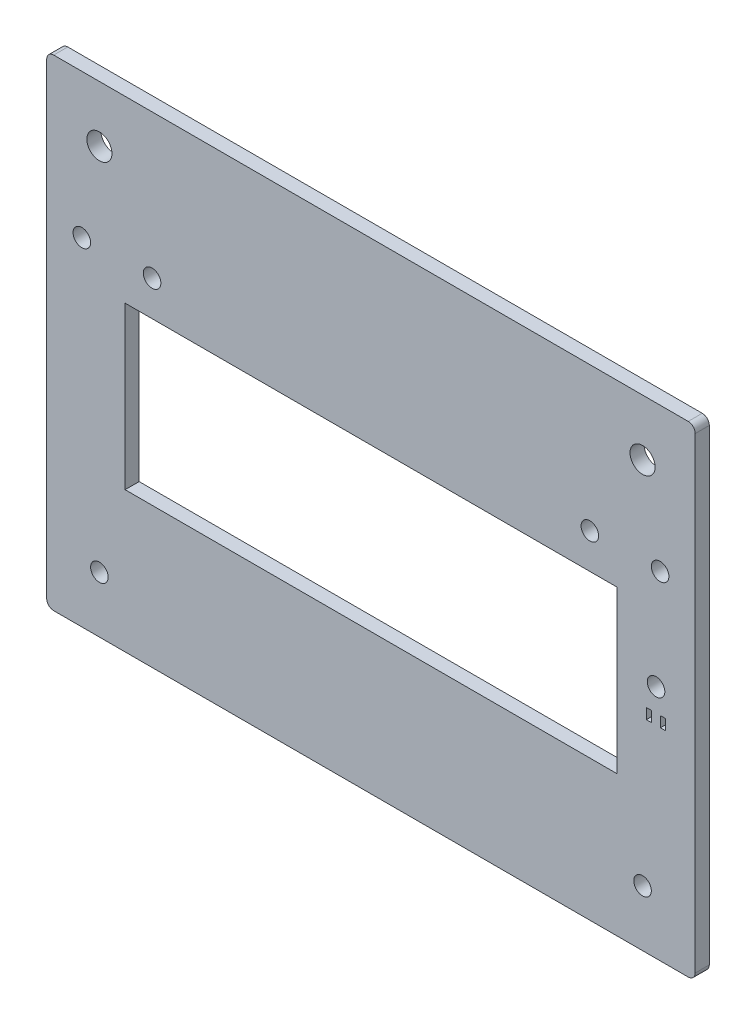
ISO-10303-21;
HEADER;
FILE_DESCRIPTION(('STEP AP214'),'2;1');
FILE_NAME('part.step','',(''),(''),'','','');
FILE_SCHEMA(('AUTOMOTIVE_DESIGN { 1 0 10303 214 1 1 1 1 }'));
ENDSEC;
DATA;
#1=APPLICATION_CONTEXT('core data for automotive mechanical design processes');
#2=APPLICATION_PROTOCOL_DEFINITION('international standard','automotive_design',2000,#1);
#3=PRODUCT_CONTEXT('',#1,'mechanical');
#4=PRODUCT('Part','Part','',(#3));
#5=PRODUCT_RELATED_PRODUCT_CATEGORY('part','',(#4));
#6=PRODUCT_DEFINITION_FORMATION('','',#4);
#7=PRODUCT_DEFINITION_CONTEXT('part definition',#1,'design');
#8=PRODUCT_DEFINITION('design','',#6,#7);
#9=PRODUCT_DEFINITION_SHAPE('','',#8);
#10=(LENGTH_UNIT() NAMED_UNIT(*) SI_UNIT(.MILLI.,.METRE.));
#11=(NAMED_UNIT(*) PLANE_ANGLE_UNIT() SI_UNIT($,.RADIAN.));
#12=(NAMED_UNIT(*) SI_UNIT($,.STERADIAN.) SOLID_ANGLE_UNIT());
#13=UNCERTAINTY_MEASURE_WITH_UNIT(LENGTH_MEASURE(1.E-05),#10,'distance_accuracy_value','');
#14=(GEOMETRIC_REPRESENTATION_CONTEXT(3) GLOBAL_UNCERTAINTY_ASSIGNED_CONTEXT((#13)) GLOBAL_UNIT_ASSIGNED_CONTEXT((#10,
#11,#12)) REPRESENTATION_CONTEXT('',''));
#15=CARTESIAN_POINT('',(0.,0.,0.));
#16=DIRECTION('',(0.,0.,1.));
#17=DIRECTION('',(1.,0.,0.));
#18=AXIS2_PLACEMENT_3D('',#15,#16,#17);
#19=CARTESIAN_POINT('',(0.,0.,4.));
#20=DIRECTION('',(0.,0.,1.));
#21=DIRECTION('',(1.,0.,0.));
#22=AXIS2_PLACEMENT_3D('',#19,#20,#21);
#23=PLANE('',#22);
#24=DIRECTION('',(0.,-1.,0.));
#25=VECTOR('',#24,1.);
#26=CARTESIAN_POINT('',(174.73,60.5,4.));
#27=LINE('',#26,#25);
#28=CARTESIAN_POINT('',(174.73,60.5,4.));
#29=VERTEX_POINT('',#28);
#30=CARTESIAN_POINT('',(174.73,57.5,4.));
#31=VERTEX_POINT('',#30);
#32=EDGE_CURVE('E55',#29,#31,#27,.T.);
#33=ORIENTED_EDGE('',*,*,#32,.F.);
#34=DIRECTION('',(-1.,0.,0.));
#35=VECTOR('',#34,1.);
#36=CARTESIAN_POINT('',(174.73,60.5,4.));
#37=LINE('',#36,#35);
#38=CARTESIAN_POINT('',(176.23,60.5,4.));
#39=VERTEX_POINT('',#38);
#40=EDGE_CURVE('E195',#39,#29,#37,.T.);
#41=ORIENTED_EDGE('',*,*,#40,.F.);
#42=DIRECTION('',(0.,1.,0.));
#43=VECTOR('',#42,1.);
#44=CARTESIAN_POINT('',(176.23,60.5,4.));
#45=LINE('',#44,#43);
#46=CARTESIAN_POINT('',(176.23,57.5,4.));
#47=VERTEX_POINT('',#46);
#48=EDGE_CURVE('E198',#47,#39,#45,.T.);
#49=ORIENTED_EDGE('',*,*,#48,.F.);
#50=DIRECTION('',(1.,0.,0.));
#51=VECTOR('',#50,1.);
#52=CARTESIAN_POINT('',(174.73,57.5,4.));
#53=LINE('',#52,#51);
#54=EDGE_CURVE('E204',#31,#47,#53,.T.);
#55=ORIENTED_EDGE('',*,*,#54,.F.);
#56=EDGE_LOOP('',(#33,#41,#49,#55));
#57=FACE_BOUND('',#56,.T.);
#58=DIRECTION('',(0.,-1.,0.));
#59=VECTOR('',#58,1.);
#60=CARTESIAN_POINT('',(170.73,60.5,4.));
#61=LINE('',#60,#59);
#62=CARTESIAN_POINT('',(170.73,60.5,4.));
#63=VERTEX_POINT('',#62);
#64=CARTESIAN_POINT('',(170.73,57.5,4.));
#65=VERTEX_POINT('',#64);
#66=EDGE_CURVE('E210',#63,#65,#61,.T.);
#67=ORIENTED_EDGE('',*,*,#66,.F.);
#68=DIRECTION('',(-1.,0.,0.));
#69=VECTOR('',#68,1.);
#70=CARTESIAN_POINT('',(170.73,60.5,4.));
#71=LINE('',#70,#69);
#72=CARTESIAN_POINT('',(172.23,60.5,4.));
#73=VERTEX_POINT('',#72);
#74=EDGE_CURVE('E218',#73,#63,#71,.T.);
#75=ORIENTED_EDGE('',*,*,#74,.F.);
#76=DIRECTION('',(0.,1.,0.));
#77=VECTOR('',#76,1.);
#78=CARTESIAN_POINT('',(172.23,60.5,4.));
#79=LINE('',#78,#77);
#80=CARTESIAN_POINT('',(172.23,57.5,4.));
#81=VERTEX_POINT('',#80);
#82=EDGE_CURVE('E232',#81,#73,#79,.T.);
#83=ORIENTED_EDGE('',*,*,#82,.F.);
#84=DIRECTION('',(1.,0.,0.));
#85=VECTOR('',#84,1.);
#86=CARTESIAN_POINT('',(170.73,57.5,4.));
#87=LINE('',#86,#85);
#88=EDGE_CURVE('E229',#65,#81,#87,.T.);
#89=ORIENTED_EDGE('',*,*,#88,.F.);
#90=EDGE_LOOP('',(#67,#75,#83,#89));
#91=FACE_BOUND('',#90,.T.);
#92=CARTESIAN_POINT('',(173.48,67.,4.));
#93=DIRECTION('',(0.,0.,1.));
#94=DIRECTION('',(1.,0.,0.));
#95=AXIS2_PLACEMENT_3D('',#92,#93,#94);
#96=CIRCLE('',#95,2.5);
#97=CARTESIAN_POINT('',(175.98,67.,4.));
#98=VERTEX_POINT('',#97);
#99=EDGE_CURVE('E239',#98,#98,#96,.T.);
#100=ORIENTED_EDGE('',*,*,#99,.F.);
#101=EDGE_LOOP('',(#100));
#102=FACE_BOUND('',#101,.T.);
#103=CARTESIAN_POINT('',(174.64,96.,4.));
#104=DIRECTION('',(0.,0.,1.));
#105=DIRECTION('',(1.,0.,0.));
#106=AXIS2_PLACEMENT_3D('',#103,#104,#105);
#107=CIRCLE('',#106,2.5);
#108=CARTESIAN_POINT('',(177.14,96.,4.));
#109=VERTEX_POINT('',#108);
#110=EDGE_CURVE('E252',#109,#109,#107,.T.);
#111=ORIENTED_EDGE('',*,*,#110,.F.);
#112=EDGE_LOOP('',(#111));
#113=FACE_BOUND('',#112,.T.);
#114=CARTESIAN_POINT('',(9.99999999999995,96.,4.));
#115=DIRECTION('',(0.,0.,1.));
#116=DIRECTION('',(1.,0.,0.));
#117=AXIS2_PLACEMENT_3D('',#114,#115,#116);
#118=CIRCLE('',#117,2.5);
#119=CARTESIAN_POINT('',(12.5,96.,4.));
#120=VERTEX_POINT('',#119);
#121=EDGE_CURVE('E251',#120,#120,#118,.T.);
#122=ORIENTED_EDGE('',*,*,#121,.F.);
#123=EDGE_LOOP('',(#122));
#124=FACE_BOUND('',#123,.T.);
#125=DIRECTION('',(0.,1.,0.));
#126=VECTOR('',#125,1.);
#127=CARTESIAN_POINT('',(184.64,137.,4.));
#128=LINE('',#127,#126);
#129=CARTESIAN_POINT('',(184.64,2.,4.));
#130=VERTEX_POINT('',#129);
#131=CARTESIAN_POINT('',(184.64,135.,4.));
#132=VERTEX_POINT('',#131);
#133=EDGE_CURVE('E333',#130,#132,#128,.T.);
#134=ORIENTED_EDGE('',*,*,#133,.T.);
#135=CARTESIAN_POINT('',(182.64,135.,4.));
#136=DIRECTION('',(0.,0.,1.));
#137=DIRECTION('',(1.,0.,0.));
#138=AXIS2_PLACEMENT_3D('',#135,#136,#137);
#139=CIRCLE('',#138,2.);
#140=CARTESIAN_POINT('',(182.64,137.,4.));
#141=VERTEX_POINT('',#140);
#142=EDGE_CURVE('E372',#132,#141,#139,.T.);
#143=ORIENTED_EDGE('',*,*,#142,.T.);
#144=DIRECTION('',(-1.,0.,0.));
#145=VECTOR('',#144,1.);
#146=CARTESIAN_POINT('',(0.,137.,4.));
#147=LINE('',#146,#145);
#148=CARTESIAN_POINT('',(2.,137.,4.));
#149=VERTEX_POINT('',#148);
#150=EDGE_CURVE('E335',#141,#149,#147,.T.);
#151=ORIENTED_EDGE('',*,*,#150,.T.);
#152=CARTESIAN_POINT('',(2.,135.,4.));
#153=DIRECTION('',(0.,0.,1.));
#154=DIRECTION('',(1.,0.,0.));
#155=AXIS2_PLACEMENT_3D('',#152,#153,#154);
#156=CIRCLE('',#155,2.);
#157=CARTESIAN_POINT('',(0.,135.,4.));
#158=VERTEX_POINT('',#157);
#159=EDGE_CURVE('E374',#149,#158,#156,.T.);
#160=ORIENTED_EDGE('',*,*,#159,.T.);
#161=DIRECTION('',(0.,-1.,0.));
#162=VECTOR('',#161,1.);
#163=CARTESIAN_POINT('',(0.,137.,4.));
#164=LINE('',#163,#162);
#165=CARTESIAN_POINT('',(0.,2.,4.));
#166=VERTEX_POINT('',#165);
#167=EDGE_CURVE('E327',#158,#166,#164,.T.);
#168=ORIENTED_EDGE('',*,*,#167,.T.);
#169=CARTESIAN_POINT('',(2.,2.,4.));
#170=DIRECTION('',(0.,0.,1.));
#171=DIRECTION('',(1.,0.,0.));
#172=AXIS2_PLACEMENT_3D('',#169,#170,#171);
#173=CIRCLE('',#172,2.);
#174=CARTESIAN_POINT('',(2.,0.,4.));
#175=VERTEX_POINT('',#174);
#176=EDGE_CURVE('E376',#166,#175,#173,.T.);
#177=ORIENTED_EDGE('',*,*,#176,.T.);
#178=DIRECTION('',(1.,0.,0.));
#179=VECTOR('',#178,1.);
#180=CARTESIAN_POINT('',(0.,0.,4.));
#181=LINE('',#180,#179);
#182=CARTESIAN_POINT('',(182.64,0.,4.));
#183=VERTEX_POINT('',#182);
#184=EDGE_CURVE('E329',#175,#183,#181,.T.);
#185=ORIENTED_EDGE('',*,*,#184,.T.);
#186=CARTESIAN_POINT('',(182.64,2.,4.));
#187=DIRECTION('',(0.,0.,1.));
#188=DIRECTION('',(1.,0.,0.));
#189=AXIS2_PLACEMENT_3D('',#186,#187,#188);
#190=CIRCLE('',#189,2.);
#191=EDGE_CURVE('E370',#183,#130,#190,.T.);
#192=ORIENTED_EDGE('',*,*,#191,.T.);
#193=EDGE_LOOP('',(#134,#143,#151,#160,#168,#177,#185,#192));
#194=FACE_BOUND('',#193,.T.);
#195=CARTESIAN_POINT('',(169.64,16.,4.));
#196=DIRECTION('',(0.,0.,1.));
#197=DIRECTION('',(1.,0.,0.));
#198=AXIS2_PLACEMENT_3D('',#195,#196,#197);
#199=CIRCLE('',#198,2.5);
#200=CARTESIAN_POINT('',(172.14,16.,4.));
#201=VERTEX_POINT('',#200);
#202=EDGE_CURVE('E258',#201,#201,#199,.T.);
#203=ORIENTED_EDGE('',*,*,#202,.F.);
#204=EDGE_LOOP('',(#203));
#205=FACE_BOUND('',#204,.T.);
#206=CARTESIAN_POINT('',(15.,16.,4.));
#207=DIRECTION('',(0.,0.,1.));
#208=DIRECTION('',(1.,0.,0.));
#209=AXIS2_PLACEMENT_3D('',#206,#207,#208);
#210=CIRCLE('',#209,2.49999999999999);
#211=CARTESIAN_POINT('',(17.5,16.,4.));
#212=VERTEX_POINT('',#211);
#213=EDGE_CURVE('E264',#212,#212,#210,.T.);
#214=ORIENTED_EDGE('',*,*,#213,.F.);
#215=EDGE_LOOP('',(#214));
#216=FACE_BOUND('',#215,.T.);
#217=DIRECTION('',(1.,0.,0.));
#218=VECTOR('',#217,1.);
#219=CARTESIAN_POINT('',(22.3199999999999,40.,4.));
#220=LINE('',#219,#218);
#221=CARTESIAN_POINT('',(22.3199999999999,40.,4.));
#222=VERTEX_POINT('',#221);
#223=CARTESIAN_POINT('',(162.32,40.,4.));
#224=VERTEX_POINT('',#223);
#225=EDGE_CURVE('E270',#222,#224,#220,.T.);
#226=ORIENTED_EDGE('',*,*,#225,.F.);
#227=DIRECTION('',(0.,-1.,0.));
#228=VECTOR('',#227,1.);
#229=CARTESIAN_POINT('',(22.3199999999999,86.,4.));
#230=LINE('',#229,#228);
#231=CARTESIAN_POINT('',(22.3199999999999,86.,4.));
#232=VERTEX_POINT('',#231);
#233=EDGE_CURVE('E302',#232,#222,#230,.T.);
#234=ORIENTED_EDGE('',*,*,#233,.F.);
#235=DIRECTION('',(-1.,0.,0.));
#236=VECTOR('',#235,1.);
#237=CARTESIAN_POINT('',(40.,86.,4.));
#238=LINE('',#237,#236);
#239=CARTESIAN_POINT('',(162.32,86.,4.));
#240=VERTEX_POINT('',#239);
#241=EDGE_CURVE('E300',#240,#232,#238,.T.);
#242=ORIENTED_EDGE('',*,*,#241,.F.);
#243=DIRECTION('',(0.,1.,0.));
#244=VECTOR('',#243,1.);
#245=CARTESIAN_POINT('',(162.32,56.,4.));
#246=LINE('',#245,#244);
#247=EDGE_CURVE('E305',#224,#240,#246,.T.);
#248=ORIENTED_EDGE('',*,*,#247,.F.);
#249=EDGE_LOOP('',(#226,#234,#242,#248));
#250=FACE_BOUND('',#249,.T.);
#251=CARTESIAN_POINT('',(30.,96.,4.));
#252=DIRECTION('',(0.,0.,1.));
#253=DIRECTION('',(1.,0.,0.));
#254=AXIS2_PLACEMENT_3D('',#251,#252,#253);
#255=CIRCLE('',#254,2.5);
#256=CARTESIAN_POINT('',(32.4999999999999,96.,4.));
#257=VERTEX_POINT('',#256);
#258=EDGE_CURVE('E288',#257,#257,#255,.T.);
#259=ORIENTED_EDGE('',*,*,#258,.F.);
#260=EDGE_LOOP('',(#259));
#261=FACE_BOUND('',#260,.T.);
#262=CARTESIAN_POINT('',(15.,121.,4.));
#263=DIRECTION('',(0.,0.,1.));
#264=DIRECTION('',(1.,0.,0.));
#265=AXIS2_PLACEMENT_3D('',#262,#263,#264);
#266=CIRCLE('',#265,3.57);
#267=CARTESIAN_POINT('',(18.57,121.,4.));
#268=VERTEX_POINT('',#267);
#269=EDGE_CURVE('E321',#268,#268,#266,.T.);
#270=ORIENTED_EDGE('',*,*,#269,.F.);
#271=EDGE_LOOP('',(#270));
#272=FACE_BOUND('',#271,.T.);
#273=CARTESIAN_POINT('',(169.64,121.,4.));
#274=DIRECTION('',(0.,0.,1.));
#275=DIRECTION('',(1.,0.,0.));
#276=AXIS2_PLACEMENT_3D('',#273,#274,#275);
#277=CIRCLE('',#276,3.56999999999998);
#278=CARTESIAN_POINT('',(173.21,121.,4.));
#279=VERTEX_POINT('',#278);
#280=EDGE_CURVE('E294',#279,#279,#277,.T.);
#281=ORIENTED_EDGE('',*,*,#280,.F.);
#282=EDGE_LOOP('',(#281));
#283=FACE_BOUND('',#282,.T.);
#284=CARTESIAN_POINT('',(154.64,96.,4.));
#285=DIRECTION('',(0.,0.,1.));
#286=DIRECTION('',(1.,0.,0.));
#287=AXIS2_PLACEMENT_3D('',#284,#285,#286);
#288=CIRCLE('',#287,2.5);
#289=CARTESIAN_POINT('',(157.14,96.,4.));
#290=VERTEX_POINT('',#289);
#291=EDGE_CURVE('E282',#290,#290,#288,.T.);
#292=ORIENTED_EDGE('',*,*,#291,.F.);
#293=EDGE_LOOP('',(#292));
#294=FACE_BOUND('',#293,.T.);
#295=ADVANCED_FACE('F39',(#57,#91,#102,#113,#124,#194,#205,#216,#250,#261,#272,#283,#294),#23,.T.);
#296=CARTESIAN_POINT('',(0.,0.,0.));
#297=DIRECTION('',(0.,0.,1.));
#298=DIRECTION('',(1.,0.,0.));
#299=AXIS2_PLACEMENT_3D('',#296,#297,#298);
#300=PLANE('',#299);
#301=DIRECTION('',(-1.,0.,0.));
#302=VECTOR('',#301,1.);
#303=CARTESIAN_POINT('',(174.73,60.5,0.));
#304=LINE('',#303,#302);
#305=CARTESIAN_POINT('',(176.23,60.5,0.));
#306=VERTEX_POINT('',#305);
#307=CARTESIAN_POINT('',(174.73,60.5,0.));
#308=VERTEX_POINT('',#307);
#309=EDGE_CURVE('E185',#306,#308,#304,.T.);
#310=ORIENTED_EDGE('',*,*,#309,.T.);
#311=DIRECTION('',(0.,-1.,0.));
#312=VECTOR('',#311,1.);
#313=CARTESIAN_POINT('',(174.73,60.5,0.));
#314=LINE('',#313,#312);
#315=CARTESIAN_POINT('',(174.73,57.5,0.));
#316=VERTEX_POINT('',#315);
#317=EDGE_CURVE('E179',#308,#316,#314,.T.);
#318=ORIENTED_EDGE('',*,*,#317,.T.);
#319=DIRECTION('',(1.,0.,0.));
#320=VECTOR('',#319,1.);
#321=CARTESIAN_POINT('',(174.73,57.5,0.));
#322=LINE('',#321,#320);
#323=CARTESIAN_POINT('',(176.23,57.5,0.));
#324=VERTEX_POINT('',#323);
#325=EDGE_CURVE('E188',#316,#324,#322,.T.);
#326=ORIENTED_EDGE('',*,*,#325,.T.);
#327=DIRECTION('',(0.,1.,0.));
#328=VECTOR('',#327,1.);
#329=CARTESIAN_POINT('',(176.23,60.5,0.));
#330=LINE('',#329,#328);
#331=EDGE_CURVE('E63',#324,#306,#330,.T.);
#332=ORIENTED_EDGE('',*,*,#331,.T.);
#333=EDGE_LOOP('',(#310,#318,#326,#332));
#334=FACE_BOUND('',#333,.T.);
#335=DIRECTION('',(-1.,0.,0.));
#336=VECTOR('',#335,1.);
#337=CARTESIAN_POINT('',(170.73,60.5,0.));
#338=LINE('',#337,#336);
#339=CARTESIAN_POINT('',(172.23,60.5,0.));
#340=VERTEX_POINT('',#339);
#341=CARTESIAN_POINT('',(170.73,60.5,0.));
#342=VERTEX_POINT('',#341);
#343=EDGE_CURVE('E224',#340,#342,#338,.T.);
#344=ORIENTED_EDGE('',*,*,#343,.T.);
#345=DIRECTION('',(0.,-1.,0.));
#346=VECTOR('',#345,1.);
#347=CARTESIAN_POINT('',(170.73,60.5,0.));
#348=LINE('',#347,#346);
#349=CARTESIAN_POINT('',(170.73,57.5,0.));
#350=VERTEX_POINT('',#349);
#351=EDGE_CURVE('E214',#342,#350,#348,.T.);
#352=ORIENTED_EDGE('',*,*,#351,.T.);
#353=DIRECTION('',(1.,0.,0.));
#354=VECTOR('',#353,1.);
#355=CARTESIAN_POINT('',(170.73,57.5,0.));
#356=LINE('',#355,#354);
#357=CARTESIAN_POINT('',(172.23,57.5,0.));
#358=VERTEX_POINT('',#357);
#359=EDGE_CURVE('E217',#350,#358,#356,.T.);
#360=ORIENTED_EDGE('',*,*,#359,.T.);
#361=DIRECTION('',(0.,1.,0.));
#362=VECTOR('',#361,1.);
#363=CARTESIAN_POINT('',(172.23,60.5,0.));
#364=LINE('',#363,#362);
#365=EDGE_CURVE('E221',#358,#340,#364,.T.);
#366=ORIENTED_EDGE('',*,*,#365,.T.);
#367=EDGE_LOOP('',(#344,#352,#360,#366));
#368=FACE_BOUND('',#367,.T.);
#369=CARTESIAN_POINT('',(173.48,67.,0.));
#370=DIRECTION('',(0.,0.,1.));
#371=DIRECTION('',(1.,0.,0.));
#372=AXIS2_PLACEMENT_3D('',#369,#370,#371);
#373=CIRCLE('',#372,2.5);
#374=CARTESIAN_POINT('',(175.98,67.,0.));
#375=VERTEX_POINT('',#374);
#376=EDGE_CURVE('E43',#375,#375,#373,.T.);
#377=ORIENTED_EDGE('',*,*,#376,.T.);
#378=EDGE_LOOP('',(#377));
#379=FACE_BOUND('',#378,.T.);
#380=CARTESIAN_POINT('',(174.64,96.,0.));
#381=DIRECTION('',(0.,0.,1.));
#382=DIRECTION('',(1.,0.,0.));
#383=AXIS2_PLACEMENT_3D('',#380,#381,#382);
#384=CIRCLE('',#383,2.5);
#385=CARTESIAN_POINT('',(177.14,96.,0.));
#386=VERTEX_POINT('',#385);
#387=EDGE_CURVE('E248',#386,#386,#384,.T.);
#388=ORIENTED_EDGE('',*,*,#387,.T.);
#389=EDGE_LOOP('',(#388));
#390=FACE_BOUND('',#389,.T.);
#391=CARTESIAN_POINT('',(9.99999999999995,96.,0.));
#392=DIRECTION('',(0.,0.,1.));
#393=DIRECTION('',(1.,0.,0.));
#394=AXIS2_PLACEMENT_3D('',#391,#392,#393);
#395=CIRCLE('',#394,2.5);
#396=CARTESIAN_POINT('',(12.5,96.,0.));
#397=VERTEX_POINT('',#396);
#398=EDGE_CURVE('E255',#397,#397,#395,.T.);
#399=ORIENTED_EDGE('',*,*,#398,.T.);
#400=EDGE_LOOP('',(#399));
#401=FACE_BOUND('',#400,.T.);
#402=CARTESIAN_POINT('',(2.,2.,0.));
#403=DIRECTION('',(0.,0.,1.));
#404=DIRECTION('',(1.,0.,0.));
#405=AXIS2_PLACEMENT_3D('',#402,#403,#404);
#406=CIRCLE('',#405,2.);
#407=CARTESIAN_POINT('',(2.,0.,0.));
#408=VERTEX_POINT('',#407);
#409=CARTESIAN_POINT('',(0.,2.,0.));
#410=VERTEX_POINT('',#409);
#411=EDGE_CURVE('E361',#408,#410,#406,.F.);
#412=ORIENTED_EDGE('',*,*,#411,.T.);
#413=DIRECTION('',(0.,-1.,0.));
#414=VECTOR('',#413,1.);
#415=CARTESIAN_POINT('',(0.,137.,0.));
#416=LINE('',#415,#414);
#417=CARTESIAN_POINT('',(0.,135.,0.));
#418=VERTEX_POINT('',#417);
#419=EDGE_CURVE('E324',#418,#410,#416,.T.);
#420=ORIENTED_EDGE('',*,*,#419,.F.);
#421=CARTESIAN_POINT('',(2.,135.,0.));
#422=DIRECTION('',(0.,0.,1.));
#423=DIRECTION('',(1.,0.,0.));
#424=AXIS2_PLACEMENT_3D('',#421,#422,#423);
#425=CIRCLE('',#424,2.);
#426=CARTESIAN_POINT('',(2.,137.,0.));
#427=VERTEX_POINT('',#426);
#428=EDGE_CURVE('E359',#418,#427,#425,.F.);
#429=ORIENTED_EDGE('',*,*,#428,.T.);
#430=DIRECTION('',(-1.,0.,0.));
#431=VECTOR('',#430,1.);
#432=CARTESIAN_POINT('',(0.,137.,0.));
#433=LINE('',#432,#431);
#434=CARTESIAN_POINT('',(182.64,137.,0.));
#435=VERTEX_POINT('',#434);
#436=EDGE_CURVE('E330',#435,#427,#433,.T.);
#437=ORIENTED_EDGE('',*,*,#436,.F.);
#438=CARTESIAN_POINT('',(182.64,135.,0.));
#439=DIRECTION('',(0.,0.,1.));
#440=DIRECTION('',(1.,0.,0.));
#441=AXIS2_PLACEMENT_3D('',#438,#439,#440);
#442=CIRCLE('',#441,2.);
#443=CARTESIAN_POINT('',(184.64,135.,0.));
#444=VERTEX_POINT('',#443);
#445=EDGE_CURVE('E356',#435,#444,#442,.F.);
#446=ORIENTED_EDGE('',*,*,#445,.T.);
#447=DIRECTION('',(0.,1.,0.));
#448=VECTOR('',#447,1.);
#449=CARTESIAN_POINT('',(184.64,137.,0.));
#450=LINE('',#449,#448);
#451=CARTESIAN_POINT('',(184.64,2.,0.));
#452=VERTEX_POINT('',#451);
#453=EDGE_CURVE('E343',#452,#444,#450,.T.);
#454=ORIENTED_EDGE('',*,*,#453,.F.);
#455=CARTESIAN_POINT('',(182.64,2.,0.));
#456=DIRECTION('',(0.,0.,1.));
#457=DIRECTION('',(1.,0.,0.));
#458=AXIS2_PLACEMENT_3D('',#455,#456,#457);
#459=CIRCLE('',#458,2.);
#460=CARTESIAN_POINT('',(182.64,0.,0.));
#461=VERTEX_POINT('',#460);
#462=EDGE_CURVE('E354',#452,#461,#459,.F.);
#463=ORIENTED_EDGE('',*,*,#462,.T.);
#464=DIRECTION('',(1.,0.,0.));
#465=VECTOR('',#464,1.);
#466=CARTESIAN_POINT('',(0.,0.,0.));
#467=LINE('',#466,#465);
#468=EDGE_CURVE('E340',#408,#461,#467,.T.);
#469=ORIENTED_EDGE('',*,*,#468,.F.);
#470=EDGE_LOOP('',(#412,#420,#429,#437,#446,#454,#463,#469));
#471=FACE_BOUND('',#470,.T.);
#472=CARTESIAN_POINT('',(169.64,16.,0.));
#473=DIRECTION('',(0.,0.,1.));
#474=DIRECTION('',(1.,0.,0.));
#475=AXIS2_PLACEMENT_3D('',#472,#473,#474);
#476=CIRCLE('',#475,2.5);
#477=CARTESIAN_POINT('',(172.14,16.,0.));
#478=VERTEX_POINT('',#477);
#479=EDGE_CURVE('E261',#478,#478,#476,.T.);
#480=ORIENTED_EDGE('',*,*,#479,.T.);
#481=EDGE_LOOP('',(#480));
#482=FACE_BOUND('',#481,.T.);
#483=CARTESIAN_POINT('',(15.,16.,0.));
#484=DIRECTION('',(0.,0.,1.));
#485=DIRECTION('',(1.,0.,0.));
#486=AXIS2_PLACEMENT_3D('',#483,#484,#485);
#487=CIRCLE('',#486,2.49999999999999);
#488=CARTESIAN_POINT('',(17.5,16.,0.));
#489=VERTEX_POINT('',#488);
#490=EDGE_CURVE('E267',#489,#489,#487,.T.);
#491=ORIENTED_EDGE('',*,*,#490,.T.);
#492=EDGE_LOOP('',(#491));
#493=FACE_BOUND('',#492,.T.);
#494=CARTESIAN_POINT('',(154.64,96.,0.));
#495=DIRECTION('',(0.,0.,1.));
#496=DIRECTION('',(1.,0.,0.));
#497=AXIS2_PLACEMENT_3D('',#494,#495,#496);
#498=CIRCLE('',#497,2.5);
#499=CARTESIAN_POINT('',(157.14,96.,0.));
#500=VERTEX_POINT('',#499);
#501=EDGE_CURVE('E279',#500,#500,#498,.T.);
#502=ORIENTED_EDGE('',*,*,#501,.T.);
#503=EDGE_LOOP('',(#502));
#504=FACE_BOUND('',#503,.T.);
#505=CARTESIAN_POINT('',(30.,96.,0.));
#506=DIRECTION('',(0.,0.,1.));
#507=DIRECTION('',(1.,0.,0.));
#508=AXIS2_PLACEMENT_3D('',#505,#506,#507);
#509=CIRCLE('',#508,2.5);
#510=CARTESIAN_POINT('',(32.4999999999999,96.,0.));
#511=VERTEX_POINT('',#510);
#512=EDGE_CURVE('E285',#511,#511,#509,.T.);
#513=ORIENTED_EDGE('',*,*,#512,.T.);
#514=EDGE_LOOP('',(#513));
#515=FACE_BOUND('',#514,.T.);
#516=CARTESIAN_POINT('',(169.64,121.,0.));
#517=DIRECTION('',(0.,0.,1.));
#518=DIRECTION('',(1.,0.,0.));
#519=AXIS2_PLACEMENT_3D('',#516,#517,#518);
#520=CIRCLE('',#519,3.56999999999998);
#521=CARTESIAN_POINT('',(173.21,121.,0.));
#522=VERTEX_POINT('',#521);
#523=EDGE_CURVE('E291',#522,#522,#520,.T.);
#524=ORIENTED_EDGE('',*,*,#523,.T.);
#525=EDGE_LOOP('',(#524));
#526=FACE_BOUND('',#525,.T.);
#527=CARTESIAN_POINT('',(15.,121.,0.));
#528=DIRECTION('',(0.,0.,1.));
#529=DIRECTION('',(1.,0.,0.));
#530=AXIS2_PLACEMENT_3D('',#527,#528,#529);
#531=CIRCLE('',#530,3.57);
#532=CARTESIAN_POINT('',(18.57,121.,0.));
#533=VERTEX_POINT('',#532);
#534=EDGE_CURVE('E320',#533,#533,#531,.T.);
#535=ORIENTED_EDGE('',*,*,#534,.T.);
#536=EDGE_LOOP('',(#535));
#537=FACE_BOUND('',#536,.T.);
#538=DIRECTION('',(0.,-1.,0.));
#539=VECTOR('',#538,1.);
#540=CARTESIAN_POINT('',(22.3199999999999,86.,0.));
#541=LINE('',#540,#539);
#542=CARTESIAN_POINT('',(22.3199999999999,86.,0.));
#543=VERTEX_POINT('',#542);
#544=CARTESIAN_POINT('',(22.3199999999999,40.,0.));
#545=VERTEX_POINT('',#544);
#546=EDGE_CURVE('E311',#543,#545,#541,.T.);
#547=ORIENTED_EDGE('',*,*,#546,.T.);
#548=DIRECTION('',(1.,0.,0.));
#549=VECTOR('',#548,1.);
#550=CARTESIAN_POINT('',(0.,40.,0.));
#551=LINE('',#550,#549);
#552=CARTESIAN_POINT('',(162.32,40.,0.));
#553=VERTEX_POINT('',#552);
#554=EDGE_CURVE('E338',#545,#553,#551,.T.);
#555=ORIENTED_EDGE('',*,*,#554,.T.);
#556=DIRECTION('',(0.,1.,0.));
#557=VECTOR('',#556,1.);
#558=CARTESIAN_POINT('',(162.32,56.,0.));
#559=LINE('',#558,#557);
#560=CARTESIAN_POINT('',(162.32,86.,0.));
#561=VERTEX_POINT('',#560);
#562=EDGE_CURVE('E303',#553,#561,#559,.T.);
#563=ORIENTED_EDGE('',*,*,#562,.T.);
#564=DIRECTION('',(-1.,0.,0.));
#565=VECTOR('',#564,1.);
#566=CARTESIAN_POINT('',(40.,86.,0.));
#567=LINE('',#566,#565);
#568=EDGE_CURVE('E297',#561,#543,#567,.T.);
#569=ORIENTED_EDGE('',*,*,#568,.T.);
#570=EDGE_LOOP('',(#547,#555,#563,#569));
#571=FACE_BOUND('',#570,.T.);
#572=ADVANCED_FACE('F192',(#334,#368,#379,#390,#401,#471,#482,#493,#504,#515,#526,#537,#571),
#300,.F.);
#573=CARTESIAN_POINT('',(0.,137.,4.));
#574=DIRECTION('',(1.,0.,0.));
#575=DIRECTION('',(0.,1.,0.));
#576=AXIS2_PLACEMENT_3D('',#573,#574,#575);
#577=PLANE('',#576);
#578=DIRECTION('',(0.,0.,-1.));
#579=VECTOR('',#578,1.);
#580=CARTESIAN_POINT('',(0.,2.,4.));
#581=LINE('',#580,#579);
#582=EDGE_CURVE('E367',#410,#166,#581,.F.);
#583=ORIENTED_EDGE('',*,*,#582,.T.);
#584=ORIENTED_EDGE('',*,*,#167,.F.);
#585=DIRECTION('',(0.,0.,-1.));
#586=VECTOR('',#585,1.);
#587=CARTESIAN_POINT('',(0.,135.,4.));
#588=LINE('',#587,#586);
#589=EDGE_CURVE('E364',#158,#418,#588,.T.);
#590=ORIENTED_EDGE('',*,*,#589,.T.);
#591=ORIENTED_EDGE('',*,*,#419,.T.);
#592=EDGE_LOOP('',(#583,#584,#590,#591));
#593=FACE_BOUND('',#592,.T.);
#594=ADVANCED_FACE('F412',(#593),#577,.F.);
#595=CARTESIAN_POINT('',(0.,0.,4.));
#596=DIRECTION('',(0.,1.,0.));
#597=DIRECTION('',(0.,0.,1.));
#598=AXIS2_PLACEMENT_3D('',#595,#596,#597);
#599=PLANE('',#598);
#600=ORIENTED_EDGE('',*,*,#184,.F.);
#601=DIRECTION('',(0.,0.,-1.));
#602=VECTOR('',#601,1.);
#603=CARTESIAN_POINT('',(2.,0.,4.));
#604=LINE('',#603,#602);
#605=EDGE_CURVE('E351',#175,#408,#604,.T.);
#606=ORIENTED_EDGE('',*,*,#605,.T.);
#607=ORIENTED_EDGE('',*,*,#468,.T.);
#608=DIRECTION('',(0.,0.,-1.));
#609=VECTOR('',#608,1.);
#610=CARTESIAN_POINT('',(182.64,0.,4.));
#611=LINE('',#610,#609);
#612=EDGE_CURVE('E349',#461,#183,#611,.F.);
#613=ORIENTED_EDGE('',*,*,#612,.T.);
#614=EDGE_LOOP('',(#600,#606,#607,#613));
#615=FACE_BOUND('',#614,.T.);
#616=ADVANCED_FACE('F421',(#615),#599,.F.);
#617=CARTESIAN_POINT('',(184.64,137.,4.));
#618=DIRECTION('',(-1.,0.,0.));
#619=DIRECTION('',(0.,0.,1.));
#620=AXIS2_PLACEMENT_3D('',#617,#618,#619);
#621=PLANE('',#620);
#622=ORIENTED_EDGE('',*,*,#453,.T.);
#623=DIRECTION('',(0.,0.,-1.));
#624=VECTOR('',#623,1.);
#625=CARTESIAN_POINT('',(184.64,135.,4.));
#626=LINE('',#625,#624);
#627=EDGE_CURVE('E11',#444,#132,#626,.F.);
#628=ORIENTED_EDGE('',*,*,#627,.T.);
#629=ORIENTED_EDGE('',*,*,#133,.F.);
#630=DIRECTION('',(0.,0.,-1.));
#631=VECTOR('',#630,1.);
#632=CARTESIAN_POINT('',(184.64,2.,4.));
#633=LINE('',#632,#631);
#634=EDGE_CURVE('E48',#130,#452,#633,.T.);
#635=ORIENTED_EDGE('',*,*,#634,.T.);
#636=EDGE_LOOP('',(#622,#628,#629,#635));
#637=FACE_BOUND('',#636,.T.);
#638=ADVANCED_FACE('F388',(#637),#621,.F.);
#639=CARTESIAN_POINT('',(0.,137.,4.));
#640=DIRECTION('',(0.,-1.,0.));
#641=DIRECTION('',(1.,0.,0.));
#642=AXIS2_PLACEMENT_3D('',#639,#640,#641);
#643=PLANE('',#642);
#644=ORIENTED_EDGE('',*,*,#436,.T.);
#645=DIRECTION('',(0.,0.,-1.));
#646=VECTOR('',#645,1.);
#647=CARTESIAN_POINT('',(2.,137.,4.));
#648=LINE('',#647,#646);
#649=EDGE_CURVE('E381',#427,#149,#648,.F.);
#650=ORIENTED_EDGE('',*,*,#649,.T.);
#651=ORIENTED_EDGE('',*,*,#150,.F.);
#652=DIRECTION('',(0.,0.,-1.));
#653=VECTOR('',#652,1.);
#654=CARTESIAN_POINT('',(182.64,137.,4.));
#655=LINE('',#654,#653);
#656=EDGE_CURVE('E378',#141,#435,#655,.T.);
#657=ORIENTED_EDGE('',*,*,#656,.T.);
#658=EDGE_LOOP('',(#644,#650,#651,#657));
#659=FACE_BOUND('',#658,.T.);
#660=ADVANCED_FACE('F405',(#659),#643,.F.);
#661=CARTESIAN_POINT('',(15.,121.,4.));
#662=DIRECTION('',(0.,0.,-1.));
#663=DIRECTION('',(-1.,0.,0.));
#664=AXIS2_PLACEMENT_3D('',#661,#662,#663);
#665=CYLINDRICAL_SURFACE('',#664,3.57);
#666=ORIENTED_EDGE('',*,*,#269,.T.);
#667=EDGE_LOOP('',(#666));
#668=FACE_BOUND('',#667,.T.);
#669=ORIENTED_EDGE('',*,*,#534,.F.);
#670=EDGE_LOOP('',(#669));
#671=FACE_BOUND('',#670,.T.);
#672=ADVANCED_FACE('F441',(#668,#671),#665,.F.);
#673=CARTESIAN_POINT('',(40.,86.,4.));
#674=DIRECTION('',(0.,-1.,0.));
#675=DIRECTION('',(0.,0.,-1.));
#676=AXIS2_PLACEMENT_3D('',#673,#674,#675);
#677=PLANE('',#676);
#678=ORIENTED_EDGE('',*,*,#568,.F.);
#679=DIRECTION('',(0.,0.,-1.));
#680=VECTOR('',#679,1.);
#681=CARTESIAN_POINT('',(162.32,86.,4.));
#682=LINE('',#681,#680);
#683=EDGE_CURVE('E308',#240,#561,#682,.T.);
#684=ORIENTED_EDGE('',*,*,#683,.F.);
#685=ORIENTED_EDGE('',*,*,#241,.T.);
#686=DIRECTION('',(0.,0.,-1.));
#687=VECTOR('',#686,1.);
#688=CARTESIAN_POINT('',(22.3199999999999,86.,4.));
#689=LINE('',#688,#687);
#690=EDGE_CURVE('E317',#232,#543,#689,.T.);
#691=ORIENTED_EDGE('',*,*,#690,.T.);
#692=EDGE_LOOP('',(#678,#684,#685,#691));
#693=FACE_BOUND('',#692,.T.);
#694=ADVANCED_FACE('F641',(#693),#677,.T.);
#695=CARTESIAN_POINT('',(22.3199999999999,86.,4.));
#696=DIRECTION('',(1.,0.,0.));
#697=DIRECTION('',(0.,1.,0.));
#698=AXIS2_PLACEMENT_3D('',#695,#696,#697);
#699=PLANE('',#698);
#700=ORIENTED_EDGE('',*,*,#546,.F.);
#701=ORIENTED_EDGE('',*,*,#690,.F.);
#702=ORIENTED_EDGE('',*,*,#233,.T.);
#703=DIRECTION('',(0.,0.,1.));
#704=VECTOR('',#703,1.);
#705=CARTESIAN_POINT('',(22.3199999999999,40.,-6.));
#706=LINE('',#705,#704);
#707=EDGE_CURVE('E275',#545,#222,#706,.T.);
#708=ORIENTED_EDGE('',*,*,#707,.F.);
#709=EDGE_LOOP('',(#700,#701,#702,#708));
#710=FACE_BOUND('',#709,.T.);
#711=ADVANCED_FACE('F638',(#710),#699,.T.);
#712=CARTESIAN_POINT('',(162.32,56.,4.));
#713=DIRECTION('',(-1.,0.,0.));
#714=DIRECTION('',(0.,-1.,0.));
#715=AXIS2_PLACEMENT_3D('',#712,#713,#714);
#716=PLANE('',#715);
#717=ORIENTED_EDGE('',*,*,#562,.F.);
#718=DIRECTION('',(0.,0.,1.));
#719=VECTOR('',#718,1.);
#720=CARTESIAN_POINT('',(162.32,40.,-6.));
#721=LINE('',#720,#719);
#722=EDGE_CURVE('E276',#553,#224,#721,.T.);
#723=ORIENTED_EDGE('',*,*,#722,.T.);
#724=ORIENTED_EDGE('',*,*,#247,.T.);
#725=ORIENTED_EDGE('',*,*,#683,.T.);
#726=EDGE_LOOP('',(#717,#723,#724,#725));
#727=FACE_BOUND('',#726,.T.);
#728=ADVANCED_FACE('F634',(#727),#716,.T.);
#729=CARTESIAN_POINT('',(169.64,121.,4.));
#730=DIRECTION('',(0.,0.,-1.));
#731=DIRECTION('',(-1.,0.,0.));
#732=AXIS2_PLACEMENT_3D('',#729,#730,#731);
#733=CYLINDRICAL_SURFACE('',#732,3.56999999999998);
#734=ORIENTED_EDGE('',*,*,#280,.T.);
#735=EDGE_LOOP('',(#734));
#736=FACE_BOUND('',#735,.T.);
#737=ORIENTED_EDGE('',*,*,#523,.F.);
#738=EDGE_LOOP('',(#737));
#739=FACE_BOUND('',#738,.T.);
#740=ADVANCED_FACE('F630',(#736,#739),#733,.F.);
#741=CARTESIAN_POINT('',(30.,96.,4.));
#742=DIRECTION('',(0.,0.,-1.));
#743=DIRECTION('',(-1.,0.,0.));
#744=AXIS2_PLACEMENT_3D('',#741,#742,#743);
#745=CYLINDRICAL_SURFACE('',#744,2.5);
#746=ORIENTED_EDGE('',*,*,#258,.T.);
#747=EDGE_LOOP('',(#746));
#748=FACE_BOUND('',#747,.T.);
#749=ORIENTED_EDGE('',*,*,#512,.F.);
#750=EDGE_LOOP('',(#749));
#751=FACE_BOUND('',#750,.T.);
#752=ADVANCED_FACE('F626',(#748,#751),#745,.F.);
#753=CARTESIAN_POINT('',(154.64,96.,4.));
#754=DIRECTION('',(0.,0.,-1.));
#755=DIRECTION('',(-1.,0.,0.));
#756=AXIS2_PLACEMENT_3D('',#753,#754,#755);
#757=CYLINDRICAL_SURFACE('',#756,2.5);
#758=ORIENTED_EDGE('',*,*,#291,.T.);
#759=EDGE_LOOP('',(#758));
#760=FACE_BOUND('',#759,.T.);
#761=ORIENTED_EDGE('',*,*,#501,.F.);
#762=EDGE_LOOP('',(#761));
#763=FACE_BOUND('',#762,.T.);
#764=ADVANCED_FACE('F622',(#760,#763),#757,.F.);
#765=CARTESIAN_POINT('',(22.3199999999999,40.,-6.));
#766=DIRECTION('',(0.,-1.,0.));
#767=DIRECTION('',(0.,0.,-1.));
#768=AXIS2_PLACEMENT_3D('',#765,#766,#767);
#769=PLANE('',#768);
#770=ORIENTED_EDGE('',*,*,#707,.T.);
#771=ORIENTED_EDGE('',*,*,#225,.T.);
#772=ORIENTED_EDGE('',*,*,#722,.F.);
#773=ORIENTED_EDGE('',*,*,#554,.F.);
#774=EDGE_LOOP('',(#770,#771,#772,#773));
#775=FACE_BOUND('',#774,.T.);
#776=ADVANCED_FACE('F454',(#775),#769,.F.);
#777=CARTESIAN_POINT('',(2.,2.,4.));
#778=DIRECTION('',(0.,0.,-1.));
#779=DIRECTION('',(-1.,0.,0.));
#780=AXIS2_PLACEMENT_3D('',#777,#778,#779);
#781=CYLINDRICAL_SURFACE('',#780,2.);
#782=ORIENTED_EDGE('',*,*,#176,.F.);
#783=ORIENTED_EDGE('',*,*,#582,.F.);
#784=ORIENTED_EDGE('',*,*,#411,.F.);
#785=ORIENTED_EDGE('',*,*,#605,.F.);
#786=EDGE_LOOP('',(#782,#783,#784,#785));
#787=FACE_BOUND('',#786,.T.);
#788=ADVANCED_FACE('F418',(#787),#781,.T.);
#789=CARTESIAN_POINT('',(2.,135.,4.));
#790=DIRECTION('',(0.,0.,-1.));
#791=DIRECTION('',(-1.,0.,0.));
#792=AXIS2_PLACEMENT_3D('',#789,#790,#791);
#793=CYLINDRICAL_SURFACE('',#792,2.);
#794=ORIENTED_EDGE('',*,*,#159,.F.);
#795=ORIENTED_EDGE('',*,*,#649,.F.);
#796=ORIENTED_EDGE('',*,*,#428,.F.);
#797=ORIENTED_EDGE('',*,*,#589,.F.);
#798=EDGE_LOOP('',(#794,#795,#796,#797));
#799=FACE_BOUND('',#798,.T.);
#800=ADVANCED_FACE('F408',(#799),#793,.T.);
#801=CARTESIAN_POINT('',(182.64,135.,4.));
#802=DIRECTION('',(0.,0.,-1.));
#803=DIRECTION('',(-1.,0.,0.));
#804=AXIS2_PLACEMENT_3D('',#801,#802,#803);
#805=CYLINDRICAL_SURFACE('',#804,2.);
#806=ORIENTED_EDGE('',*,*,#142,.F.);
#807=ORIENTED_EDGE('',*,*,#627,.F.);
#808=ORIENTED_EDGE('',*,*,#445,.F.);
#809=ORIENTED_EDGE('',*,*,#656,.F.);
#810=EDGE_LOOP('',(#806,#807,#808,#809));
#811=FACE_BOUND('',#810,.T.);
#812=ADVANCED_FACE('F399',(#811),#805,.T.);
#813=CARTESIAN_POINT('',(182.64,2.,4.));
#814=DIRECTION('',(0.,0.,-1.));
#815=DIRECTION('',(-1.,0.,0.));
#816=AXIS2_PLACEMENT_3D('',#813,#814,#815);
#817=CYLINDRICAL_SURFACE('',#816,2.);
#818=ORIENTED_EDGE('',*,*,#191,.F.);
#819=ORIENTED_EDGE('',*,*,#612,.F.);
#820=ORIENTED_EDGE('',*,*,#462,.F.);
#821=ORIENTED_EDGE('',*,*,#634,.F.);
#822=EDGE_LOOP('',(#818,#819,#820,#821));
#823=FACE_BOUND('',#822,.T.);
#824=ADVANCED_FACE('F41',(#823),#817,.T.);
#825=CARTESIAN_POINT('',(169.64,16.,0.));
#826=DIRECTION('',(0.,0.,1.));
#827=DIRECTION('',(1.,0.,0.));
#828=AXIS2_PLACEMENT_3D('',#825,#826,#827);
#829=CYLINDRICAL_SURFACE('',#828,2.5);
#830=ORIENTED_EDGE('',*,*,#479,.F.);
#831=EDGE_LOOP('',(#830));
#832=FACE_BOUND('',#831,.T.);
#833=ORIENTED_EDGE('',*,*,#202,.T.);
#834=EDGE_LOOP('',(#833));
#835=FACE_BOUND('',#834,.T.);
#836=ADVANCED_FACE('F424',(#832,#835),#829,.F.);
#837=CARTESIAN_POINT('',(15.,16.,0.));
#838=DIRECTION('',(0.,0.,1.));
#839=DIRECTION('',(1.,0.,0.));
#840=AXIS2_PLACEMENT_3D('',#837,#838,#839);
#841=CYLINDRICAL_SURFACE('',#840,2.49999999999999);
#842=ORIENTED_EDGE('',*,*,#490,.F.);
#843=EDGE_LOOP('',(#842));
#844=FACE_BOUND('',#843,.T.);
#845=ORIENTED_EDGE('',*,*,#213,.T.);
#846=EDGE_LOOP('',(#845));
#847=FACE_BOUND('',#846,.T.);
#848=ADVANCED_FACE('F429',(#844,#847),#841,.F.);
#849=CARTESIAN_POINT('',(9.99999999999995,96.,0.));
#850=DIRECTION('',(0.,0.,1.));
#851=DIRECTION('',(1.,0.,0.));
#852=AXIS2_PLACEMENT_3D('',#849,#850,#851);
#853=CYLINDRICAL_SURFACE('',#852,2.5);
#854=ORIENTED_EDGE('',*,*,#398,.F.);
#855=EDGE_LOOP('',(#854));
#856=FACE_BOUND('',#855,.T.);
#857=ORIENTED_EDGE('',*,*,#121,.T.);
#858=EDGE_LOOP('',(#857));
#859=FACE_BOUND('',#858,.T.);
#860=ADVANCED_FACE('F501',(#856,#859),#853,.F.);
#861=CARTESIAN_POINT('',(174.64,96.,0.));
#862=DIRECTION('',(0.,0.,1.));
#863=DIRECTION('',(1.,0.,0.));
#864=AXIS2_PLACEMENT_3D('',#861,#862,#863);
#865=CYLINDRICAL_SURFACE('',#864,2.5);
#866=ORIENTED_EDGE('',*,*,#387,.F.);
#867=EDGE_LOOP('',(#866));
#868=FACE_BOUND('',#867,.T.);
#869=ORIENTED_EDGE('',*,*,#110,.T.);
#870=EDGE_LOOP('',(#869));
#871=FACE_BOUND('',#870,.T.);
#872=ADVANCED_FACE('F511',(#868,#871),#865,.F.);
#873=CARTESIAN_POINT('',(173.48,67.,-6.));
#874=DIRECTION('',(0.,0.,1.));
#875=DIRECTION('',(1.,0.,0.));
#876=AXIS2_PLACEMENT_3D('',#873,#874,#875);
#877=CYLINDRICAL_SURFACE('',#876,2.5);
#878=ORIENTED_EDGE('',*,*,#99,.T.);
#879=EDGE_LOOP('',(#878));
#880=FACE_BOUND('',#879,.T.);
#881=ORIENTED_EDGE('',*,*,#376,.F.);
#882=EDGE_LOOP('',(#881));
#883=FACE_BOUND('',#882,.T.);
#884=ADVANCED_FACE('F521',(#880,#883),#877,.F.);
#885=CARTESIAN_POINT('',(170.73,60.5,0.));
#886=DIRECTION('',(-1.,0.,0.));
#887=DIRECTION('',(0.,0.,1.));
#888=AXIS2_PLACEMENT_3D('',#885,#886,#887);
#889=PLANE('',#888);
#890=ORIENTED_EDGE('',*,*,#66,.T.);
#891=DIRECTION('',(0.,0.,1.));
#892=VECTOR('',#891,1.);
#893=CARTESIAN_POINT('',(170.73,57.5,0.));
#894=LINE('',#893,#892);
#895=EDGE_CURVE('E227',#350,#65,#894,.T.);
#896=ORIENTED_EDGE('',*,*,#895,.F.);
#897=ORIENTED_EDGE('',*,*,#351,.F.);
#898=DIRECTION('',(0.,0.,1.));
#899=VECTOR('',#898,1.);
#900=CARTESIAN_POINT('',(170.73,60.5,0.));
#901=LINE('',#900,#899);
#902=EDGE_CURVE('E237',#342,#63,#901,.T.);
#903=ORIENTED_EDGE('',*,*,#902,.T.);
#904=EDGE_LOOP('',(#890,#896,#897,#903));
#905=FACE_BOUND('',#904,.T.);
#906=ADVANCED_FACE('F530',(#905),#889,.F.);
#907=CARTESIAN_POINT('',(170.73,60.5,0.));
#908=DIRECTION('',(0.,1.,0.));
#909=DIRECTION('',(0.,0.,1.));
#910=AXIS2_PLACEMENT_3D('',#907,#908,#909);
#911=PLANE('',#910);
#912=ORIENTED_EDGE('',*,*,#74,.T.);
#913=ORIENTED_EDGE('',*,*,#902,.F.);
#914=ORIENTED_EDGE('',*,*,#343,.F.);
#915=DIRECTION('',(0.,0.,1.));
#916=VECTOR('',#915,1.);
#917=CARTESIAN_POINT('',(172.23,60.5,0.));
#918=LINE('',#917,#916);
#919=EDGE_CURVE('E240',#340,#73,#918,.T.);
#920=ORIENTED_EDGE('',*,*,#919,.T.);
#921=EDGE_LOOP('',(#912,#913,#914,#920));
#922=FACE_BOUND('',#921,.T.);
#923=ADVANCED_FACE('F551',(#922),#911,.F.);
#924=CARTESIAN_POINT('',(172.23,60.5,0.));
#925=DIRECTION('',(1.,0.,0.));
#926=DIRECTION('',(0.,0.,-1.));
#927=AXIS2_PLACEMENT_3D('',#924,#925,#926);
#928=PLANE('',#927);
#929=ORIENTED_EDGE('',*,*,#82,.T.);
#930=ORIENTED_EDGE('',*,*,#919,.F.);
#931=ORIENTED_EDGE('',*,*,#365,.F.);
#932=DIRECTION('',(0.,0.,1.));
#933=VECTOR('',#932,1.);
#934=CARTESIAN_POINT('',(172.23,57.5,0.));
#935=LINE('',#934,#933);
#936=EDGE_CURVE('E242',#358,#81,#935,.T.);
#937=ORIENTED_EDGE('',*,*,#936,.T.);
#938=EDGE_LOOP('',(#929,#930,#931,#937));
#939=FACE_BOUND('',#938,.T.);
#940=ADVANCED_FACE('F561',(#939),#928,.F.);
#941=CARTESIAN_POINT('',(170.73,57.5,0.));
#942=DIRECTION('',(0.,-1.,0.));
#943=DIRECTION('',(0.,0.,-1.));
#944=AXIS2_PLACEMENT_3D('',#941,#942,#943);
#945=PLANE('',#944);
#946=ORIENTED_EDGE('',*,*,#88,.T.);
#947=ORIENTED_EDGE('',*,*,#936,.F.);
#948=ORIENTED_EDGE('',*,*,#359,.F.);
#949=ORIENTED_EDGE('',*,*,#895,.T.);
#950=EDGE_LOOP('',(#946,#947,#948,#949));
#951=FACE_BOUND('',#950,.T.);
#952=ADVANCED_FACE('F571',(#951),#945,.F.);
#953=CARTESIAN_POINT('',(174.73,60.5,0.));
#954=DIRECTION('',(-1.,0.,0.));
#955=DIRECTION('',(0.,0.,1.));
#956=AXIS2_PLACEMENT_3D('',#953,#954,#955);
#957=PLANE('',#956);
#958=ORIENTED_EDGE('',*,*,#32,.T.);
#959=DIRECTION('',(0.,0.,1.));
#960=VECTOR('',#959,1.);
#961=CARTESIAN_POINT('',(174.73,57.5,0.));
#962=LINE('',#961,#960);
#963=EDGE_CURVE('E175',#316,#31,#962,.T.);
#964=ORIENTED_EDGE('',*,*,#963,.F.);
#965=ORIENTED_EDGE('',*,*,#317,.F.);
#966=DIRECTION('',(0.,0.,1.));
#967=VECTOR('',#966,1.);
#968=CARTESIAN_POINT('',(174.73,60.5,0.));
#969=LINE('',#968,#967);
#970=EDGE_CURVE('E208',#308,#29,#969,.T.);
#971=ORIENTED_EDGE('',*,*,#970,.T.);
#972=EDGE_LOOP('',(#958,#964,#965,#971));
#973=FACE_BOUND('',#972,.T.);
#974=ADVANCED_FACE('F177',(#973),#957,.F.);
#975=CARTESIAN_POINT('',(174.73,60.5,0.));
#976=DIRECTION('',(0.,1.,0.));
#977=DIRECTION('',(0.,0.,1.));
#978=AXIS2_PLACEMENT_3D('',#975,#976,#977);
#979=PLANE('',#978);
#980=ORIENTED_EDGE('',*,*,#40,.T.);
#981=ORIENTED_EDGE('',*,*,#970,.F.);
#982=ORIENTED_EDGE('',*,*,#309,.F.);
#983=DIRECTION('',(0.,0.,1.));
#984=VECTOR('',#983,1.);
#985=CARTESIAN_POINT('',(176.23,60.5,0.));
#986=LINE('',#985,#984);
#987=EDGE_CURVE('E211',#306,#39,#986,.T.);
#988=ORIENTED_EDGE('',*,*,#987,.T.);
#989=EDGE_LOOP('',(#980,#981,#982,#988));
#990=FACE_BOUND('',#989,.T.);
#991=ADVANCED_FACE('F590',(#990),#979,.F.);
#992=CARTESIAN_POINT('',(176.23,60.5,0.));
#993=DIRECTION('',(1.,0.,0.));
#994=DIRECTION('',(0.,0.,-1.));
#995=AXIS2_PLACEMENT_3D('',#992,#993,#994);
#996=PLANE('',#995);
#997=ORIENTED_EDGE('',*,*,#48,.T.);
#998=ORIENTED_EDGE('',*,*,#987,.F.);
#999=ORIENTED_EDGE('',*,*,#331,.F.);
#1000=DIRECTION('',(0.,0.,1.));
#1001=VECTOR('',#1000,1.);
#1002=CARTESIAN_POINT('',(176.23,57.5,0.));
#1003=LINE('',#1002,#1001);
#1004=EDGE_CURVE('E184',#324,#47,#1003,.T.);
#1005=ORIENTED_EDGE('',*,*,#1004,.T.);
#1006=EDGE_LOOP('',(#997,#998,#999,#1005));
#1007=FACE_BOUND('',#1006,.T.);
#1008=ADVANCED_FACE('F599',(#1007),#996,.F.);
#1009=CARTESIAN_POINT('',(174.73,57.5,0.));
#1010=DIRECTION('',(0.,-1.,0.));
#1011=DIRECTION('',(0.,0.,-1.));
#1012=AXIS2_PLACEMENT_3D('',#1009,#1010,#1011);
#1013=PLANE('',#1012);
#1014=ORIENTED_EDGE('',*,*,#54,.T.);
#1015=ORIENTED_EDGE('',*,*,#1004,.F.);
#1016=ORIENTED_EDGE('',*,*,#325,.F.);
#1017=ORIENTED_EDGE('',*,*,#963,.T.);
#1018=EDGE_LOOP('',(#1014,#1015,#1016,#1017));
#1019=FACE_BOUND('',#1018,.T.);
#1020=ADVANCED_FACE('F189',(#1019),#1013,.F.);
#1021=CLOSED_SHELL('',(#295,#572,#594,#616,#638,#660,#672,#694,#711,#728,#740,#752,#764,#776,
#788,#800,#812,#824,#836,#848,#860,#872,#884,#906,#923,#940,#952,#974,#991,#1008,#1020));
#1022=MANIFOLD_SOLID_BREP('B2',#1021);
#1023=ADVANCED_BREP_SHAPE_REPRESENTATION('',(#18,#1022),#14);
#1024=SHAPE_DEFINITION_REPRESENTATION(#9,#1023);
ENDSEC;
END-ISO-10303-21;
